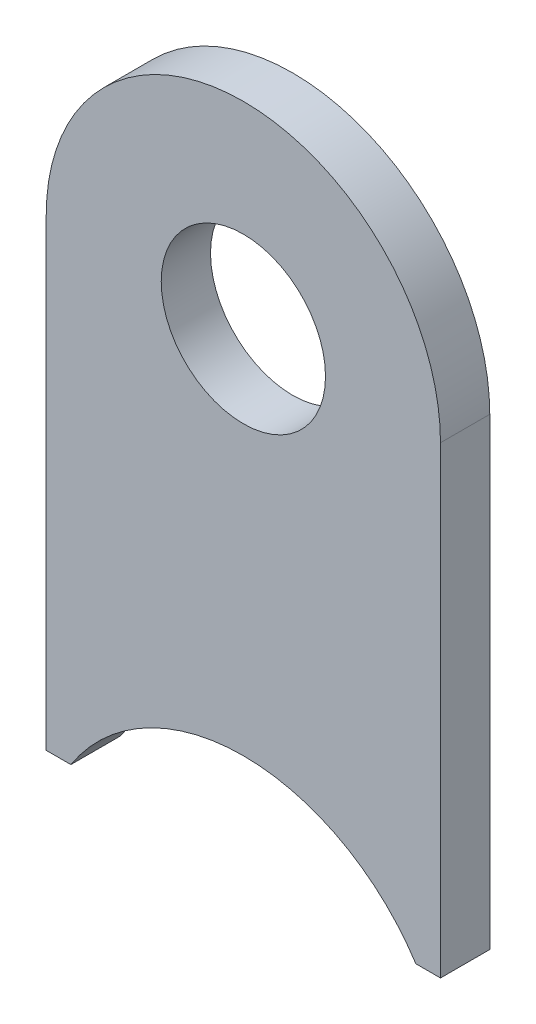
ISO-10303-21;
HEADER;
FILE_DESCRIPTION(('STEP AP214'),'2;1');
FILE_NAME('part.step','',(''),(''),'','','');
FILE_SCHEMA(('AUTOMOTIVE_DESIGN { 1 0 10303 214 1 1 1 1 }'));
ENDSEC;
DATA;
#1=APPLICATION_CONTEXT('core data for automotive mechanical design processes');
#2=APPLICATION_PROTOCOL_DEFINITION('international standard','automotive_design',2000,#1);
#3=PRODUCT_CONTEXT('',#1,'mechanical');
#4=PRODUCT('Part','Part','',(#3));
#5=PRODUCT_RELATED_PRODUCT_CATEGORY('part','',(#4));
#6=PRODUCT_DEFINITION_FORMATION('','',#4);
#7=PRODUCT_DEFINITION_CONTEXT('part definition',#1,'design');
#8=PRODUCT_DEFINITION('design','',#6,#7);
#9=PRODUCT_DEFINITION_SHAPE('','',#8);
#10=(LENGTH_UNIT() NAMED_UNIT(*) SI_UNIT(.MILLI.,.METRE.));
#11=(NAMED_UNIT(*) PLANE_ANGLE_UNIT() SI_UNIT($,.RADIAN.));
#12=(NAMED_UNIT(*) SI_UNIT($,.STERADIAN.) SOLID_ANGLE_UNIT());
#13=UNCERTAINTY_MEASURE_WITH_UNIT(LENGTH_MEASURE(1.E-05),#10,'distance_accuracy_value','');
#14=(GEOMETRIC_REPRESENTATION_CONTEXT(3) GLOBAL_UNCERTAINTY_ASSIGNED_CONTEXT((#13)) GLOBAL_UNIT_ASSIGNED_CONTEXT((#10,
#11,#12)) REPRESENTATION_CONTEXT('',''));
#15=CARTESIAN_POINT('',(0.,0.,0.));
#16=DIRECTION('',(0.,0.,1.));
#17=DIRECTION('',(1.,0.,0.));
#18=AXIS2_PLACEMENT_3D('',#15,#16,#17);
#19=CARTESIAN_POINT('',(0.,0.,1.5));
#20=DIRECTION('',(0.,0.,-1.));
#21=DIRECTION('',(-1.,0.,0.));
#22=AXIS2_PLACEMENT_3D('',#19,#20,#21);
#23=CYLINDRICAL_SURFACE('',#22,12.);
#24=CARTESIAN_POINT('',(0.,0.,-1.5));
#25=DIRECTION('',(0.,0.,-1.));
#26=DIRECTION('',(-1.,0.,0.));
#27=AXIS2_PLACEMENT_3D('',#24,#25,#26);
#28=CIRCLE('',#27,12.);
#29=CARTESIAN_POINT('',(-12.,0.,-1.5));
#30=VERTEX_POINT('',#29);
#31=CARTESIAN_POINT('',(12.,0.,-1.5));
#32=VERTEX_POINT('',#31);
#33=EDGE_CURVE('E119',#30,#32,#28,.T.);
#34=ORIENTED_EDGE('',*,*,#33,.F.);
#35=DIRECTION('',(0.,0.,-1.));
#36=VECTOR('',#35,1.);
#37=CARTESIAN_POINT('',(-12.,0.,1.5));
#38=LINE('',#37,#36);
#39=CARTESIAN_POINT('',(-12.,0.,1.5));
#40=VERTEX_POINT('',#39);
#41=EDGE_CURVE('E11',#40,#30,#38,.T.);
#42=ORIENTED_EDGE('',*,*,#41,.F.);
#43=CARTESIAN_POINT('',(0.,0.,1.5));
#44=DIRECTION('',(0.,0.,-1.));
#45=DIRECTION('',(-1.,0.,0.));
#46=AXIS2_PLACEMENT_3D('',#43,#44,#45);
#47=CIRCLE('',#46,12.);
#48=CARTESIAN_POINT('',(12.,0.,1.5));
#49=VERTEX_POINT('',#48);
#50=EDGE_CURVE('E134',#40,#49,#47,.T.);
#51=ORIENTED_EDGE('',*,*,#50,.T.);
#52=DIRECTION('',(0.,0.,-1.));
#53=VECTOR('',#52,1.);
#54=CARTESIAN_POINT('',(12.,0.,1.5));
#55=LINE('',#54,#53);
#56=EDGE_CURVE('E37',#49,#32,#55,.T.);
#57=ORIENTED_EDGE('',*,*,#56,.T.);
#58=EDGE_LOOP('',(#34,#42,#51,#57));
#59=FACE_BOUND('',#58,.T.);
#60=ADVANCED_FACE('F34',(#59),#23,.T.);
#61=CARTESIAN_POINT('',(-12.,-28.2176700168747,1.5));
#62=DIRECTION('',(-1.,0.,0.));
#63=DIRECTION('',(0.,-1.,0.));
#64=AXIS2_PLACEMENT_3D('',#61,#62,#63);
#65=PLANE('',#64);
#66=DIRECTION('',(0.,1.,0.));
#67=VECTOR('',#66,1.);
#68=CARTESIAN_POINT('',(-12.,-28.2176700168747,-1.5));
#69=LINE('',#68,#67);
#70=CARTESIAN_POINT('',(-12.,-28.2176700168747,-1.5));
#71=VERTEX_POINT('',#70);
#72=EDGE_CURVE('E132',#71,#30,#69,.T.);
#73=ORIENTED_EDGE('',*,*,#72,.F.);
#74=DIRECTION('',(0.,0.,-1.));
#75=VECTOR('',#74,1.);
#76=CARTESIAN_POINT('',(-12.,-28.2176700168747,1.5));
#77=LINE('',#76,#75);
#78=CARTESIAN_POINT('',(-12.,-28.2176700168747,1.5));
#79=VERTEX_POINT('',#78);
#80=EDGE_CURVE('E43',#79,#71,#77,.T.);
#81=ORIENTED_EDGE('',*,*,#80,.F.);
#82=DIRECTION('',(0.,1.,0.));
#83=VECTOR('',#82,1.);
#84=CARTESIAN_POINT('',(-12.,-28.2176700168747,1.5));
#85=LINE('',#84,#83);
#86=EDGE_CURVE('E109',#79,#40,#85,.T.);
#87=ORIENTED_EDGE('',*,*,#86,.T.);
#88=ORIENTED_EDGE('',*,*,#41,.T.);
#89=EDGE_LOOP('',(#73,#81,#87,#88));
#90=FACE_BOUND('',#89,.T.);
#91=ADVANCED_FACE('F142',(#90),#65,.T.);
#92=CARTESIAN_POINT('',(-10.5,-28.2176700168747,1.5));
#93=DIRECTION('',(0.,-1.,0.));
#94=DIRECTION('',(0.,0.,-1.));
#95=AXIS2_PLACEMENT_3D('',#92,#93,#94);
#96=PLANE('',#95);
#97=DIRECTION('',(-1.,0.,0.));
#98=VECTOR('',#97,1.);
#99=CARTESIAN_POINT('',(-10.5,-28.2176700168747,-1.5));
#100=LINE('',#99,#98);
#101=CARTESIAN_POINT('',(-10.5,-28.2176700168747,-1.5));
#102=VERTEX_POINT('',#101);
#103=EDGE_CURVE('E96',#102,#71,#100,.T.);
#104=ORIENTED_EDGE('',*,*,#103,.F.);
#105=DIRECTION('',(0.,0.,-1.));
#106=VECTOR('',#105,1.);
#107=CARTESIAN_POINT('',(-10.5,-28.2176700168747,1.5));
#108=LINE('',#107,#106);
#109=CARTESIAN_POINT('',(-10.5,-28.2176700168747,1.5));
#110=VERTEX_POINT('',#109);
#111=EDGE_CURVE('E91',#110,#102,#108,.T.);
#112=ORIENTED_EDGE('',*,*,#111,.F.);
#113=DIRECTION('',(-1.,0.,0.));
#114=VECTOR('',#113,1.);
#115=CARTESIAN_POINT('',(-10.5,-28.2176700168747,1.5));
#116=LINE('',#115,#114);
#117=EDGE_CURVE('E94',#110,#79,#116,.T.);
#118=ORIENTED_EDGE('',*,*,#117,.T.);
#119=ORIENTED_EDGE('',*,*,#80,.T.);
#120=EDGE_LOOP('',(#104,#112,#118,#119));
#121=FACE_BOUND('',#120,.T.);
#122=ADVANCED_FACE('F93',(#121),#96,.T.);
#123=CARTESIAN_POINT('',(0.,-35.,1.5));
#124=DIRECTION('',(0.,0.,-1.));
#125=DIRECTION('',(-1.,0.,0.));
#126=AXIS2_PLACEMENT_3D('',#123,#124,#125);
#127=CYLINDRICAL_SURFACE('',#126,12.5);
#128=CARTESIAN_POINT('',(0.,-35.,-1.5));
#129=DIRECTION('',(0.,0.,1.));
#130=DIRECTION('',(1.,0.,0.));
#131=AXIS2_PLACEMENT_3D('',#128,#129,#130);
#132=CIRCLE('',#131,12.5);
#133=CARTESIAN_POINT('',(10.5,-28.2176700168747,-1.5));
#134=VERTEX_POINT('',#133);
#135=EDGE_CURVE('E129',#134,#102,#132,.T.);
#136=ORIENTED_EDGE('',*,*,#135,.F.);
#137=DIRECTION('',(0.,0.,-1.));
#138=VECTOR('',#137,1.);
#139=CARTESIAN_POINT('',(10.5,-28.2176700168747,1.5));
#140=LINE('',#139,#138);
#141=CARTESIAN_POINT('',(10.5,-28.2176700168747,1.5));
#142=VERTEX_POINT('',#141);
#143=EDGE_CURVE('E101',#142,#134,#140,.T.);
#144=ORIENTED_EDGE('',*,*,#143,.F.);
#145=CARTESIAN_POINT('',(0.,-35.,1.5));
#146=DIRECTION('',(0.,0.,1.));
#147=DIRECTION('',(1.,0.,0.));
#148=AXIS2_PLACEMENT_3D('',#145,#146,#147);
#149=CIRCLE('',#148,12.5);
#150=EDGE_CURVE('E107',#142,#110,#149,.T.);
#151=ORIENTED_EDGE('',*,*,#150,.T.);
#152=ORIENTED_EDGE('',*,*,#111,.T.);
#153=EDGE_LOOP('',(#136,#144,#151,#152));
#154=FACE_BOUND('',#153,.T.);
#155=ADVANCED_FACE('F111',(#154),#127,.F.);
#156=CARTESIAN_POINT('',(12.,-28.2176700168747,1.5));
#157=DIRECTION('',(0.,-1.,0.));
#158=DIRECTION('',(0.,0.,-1.));
#159=AXIS2_PLACEMENT_3D('',#156,#157,#158);
#160=PLANE('',#159);
#161=DIRECTION('',(-1.,0.,0.));
#162=VECTOR('',#161,1.);
#163=CARTESIAN_POINT('',(12.,-28.2176700168747,-1.5));
#164=LINE('',#163,#162);
#165=CARTESIAN_POINT('',(12.,-28.2176700168747,-1.5));
#166=VERTEX_POINT('',#165);
#167=EDGE_CURVE('E126',#166,#134,#164,.T.);
#168=ORIENTED_EDGE('',*,*,#167,.F.);
#169=DIRECTION('',(0.,0.,-1.));
#170=VECTOR('',#169,1.);
#171=CARTESIAN_POINT('',(12.,-28.2176700168747,1.5));
#172=LINE('',#171,#170);
#173=CARTESIAN_POINT('',(12.,-28.2176700168747,1.5));
#174=VERTEX_POINT('',#173);
#175=EDGE_CURVE('E137',#174,#166,#172,.T.);
#176=ORIENTED_EDGE('',*,*,#175,.F.);
#177=DIRECTION('',(-1.,0.,0.));
#178=VECTOR('',#177,1.);
#179=CARTESIAN_POINT('',(12.,-28.2176700168747,1.5));
#180=LINE('',#179,#178);
#181=EDGE_CURVE('E112',#174,#142,#180,.T.);
#182=ORIENTED_EDGE('',*,*,#181,.T.);
#183=ORIENTED_EDGE('',*,*,#143,.T.);
#184=EDGE_LOOP('',(#168,#176,#182,#183));
#185=FACE_BOUND('',#184,.T.);
#186=ADVANCED_FACE('F155',(#185),#160,.T.);
#187=CARTESIAN_POINT('',(12.,0.,1.5));
#188=DIRECTION('',(1.,0.,0.));
#189=DIRECTION('',(0.,1.,0.));
#190=AXIS2_PLACEMENT_3D('',#187,#188,#189);
#191=PLANE('',#190);
#192=DIRECTION('',(0.,-1.,0.));
#193=VECTOR('',#192,1.);
#194=CARTESIAN_POINT('',(12.,0.,-1.5));
#195=LINE('',#194,#193);
#196=EDGE_CURVE('E122',#32,#166,#195,.T.);
#197=ORIENTED_EDGE('',*,*,#196,.F.);
#198=ORIENTED_EDGE('',*,*,#56,.F.);
#199=DIRECTION('',(0.,-1.,0.));
#200=VECTOR('',#199,1.);
#201=CARTESIAN_POINT('',(12.,0.,1.5));
#202=LINE('',#201,#200);
#203=EDGE_CURVE('E114',#49,#174,#202,.T.);
#204=ORIENTED_EDGE('',*,*,#203,.T.);
#205=ORIENTED_EDGE('',*,*,#175,.T.);
#206=EDGE_LOOP('',(#197,#198,#204,#205));
#207=FACE_BOUND('',#206,.T.);
#208=ADVANCED_FACE('F139',(#207),#191,.T.);
#209=CARTESIAN_POINT('',(0.,0.,1.5));
#210=DIRECTION('',(0.,0.,-1.));
#211=DIRECTION('',(-1.,0.,0.));
#212=AXIS2_PLACEMENT_3D('',#209,#210,#211);
#213=PLANE('',#212);
#214=CARTESIAN_POINT('',(0.,0.,1.5));
#215=DIRECTION('',(0.,0.,-1.));
#216=DIRECTION('',(1.,0.,0.));
#217=AXIS2_PLACEMENT_3D('',#214,#215,#216);
#218=CIRCLE('',#217,5.);
#219=CARTESIAN_POINT('',(5.,0.,1.5));
#220=VERTEX_POINT('',#219);
#221=EDGE_CURVE('E123',#220,#220,#218,.T.);
#222=ORIENTED_EDGE('',*,*,#221,.T.);
#223=EDGE_LOOP('',(#222));
#224=FACE_BOUND('',#223,.T.);
#225=ORIENTED_EDGE('',*,*,#50,.F.);
#226=ORIENTED_EDGE('',*,*,#86,.F.);
#227=ORIENTED_EDGE('',*,*,#117,.F.);
#228=ORIENTED_EDGE('',*,*,#150,.F.);
#229=ORIENTED_EDGE('',*,*,#181,.F.);
#230=ORIENTED_EDGE('',*,*,#203,.F.);
#231=EDGE_LOOP('',(#225,#226,#227,#228,#229,#230));
#232=FACE_BOUND('',#231,.T.);
#233=ADVANCED_FACE('F105',(#224,#232),#213,.F.);
#234=CARTESIAN_POINT('',(0.,0.,-1.5));
#235=DIRECTION('',(0.,0.,-1.));
#236=DIRECTION('',(-1.,0.,0.));
#237=AXIS2_PLACEMENT_3D('',#234,#235,#236);
#238=PLANE('',#237);
#239=CARTESIAN_POINT('',(0.,0.,-1.5));
#240=DIRECTION('',(0.,0.,-1.));
#241=DIRECTION('',(1.,0.,0.));
#242=AXIS2_PLACEMENT_3D('',#239,#240,#241);
#243=CIRCLE('',#242,5.);
#244=CARTESIAN_POINT('',(5.,0.,-1.5));
#245=VERTEX_POINT('',#244);
#246=EDGE_CURVE('E178',#245,#245,#243,.T.);
#247=ORIENTED_EDGE('',*,*,#246,.F.);
#248=EDGE_LOOP('',(#247));
#249=FACE_BOUND('',#248,.T.);
#250=ORIENTED_EDGE('',*,*,#33,.T.);
#251=ORIENTED_EDGE('',*,*,#196,.T.);
#252=ORIENTED_EDGE('',*,*,#167,.T.);
#253=ORIENTED_EDGE('',*,*,#135,.T.);
#254=ORIENTED_EDGE('',*,*,#103,.T.);
#255=ORIENTED_EDGE('',*,*,#72,.T.);
#256=EDGE_LOOP('',(#250,#251,#252,#253,#254,#255));
#257=FACE_BOUND('',#256,.T.);
#258=ADVANCED_FACE('F141',(#249,#257),#238,.T.);
#259=CARTESIAN_POINT('',(0.,0.,1.5));
#260=DIRECTION('',(0.,0.,-1.));
#261=DIRECTION('',(-1.,0.,0.));
#262=AXIS2_PLACEMENT_3D('',#259,#260,#261);
#263=CYLINDRICAL_SURFACE('',#262,5.);
#264=ORIENTED_EDGE('',*,*,#221,.F.);
#265=EDGE_LOOP('',(#264));
#266=FACE_BOUND('',#265,.T.);
#267=ORIENTED_EDGE('',*,*,#246,.T.);
#268=EDGE_LOOP('',(#267));
#269=FACE_BOUND('',#268,.T.);
#270=ADVANCED_FACE('F166',(#266,#269),#263,.F.);
#271=CLOSED_SHELL('',(#60,#91,#122,#155,#186,#208,#233,#258,#270));
#272=MANIFOLD_SOLID_BREP('B2',#271);
#273=ADVANCED_BREP_SHAPE_REPRESENTATION('',(#18,#272),#14);
#274=SHAPE_DEFINITION_REPRESENTATION(#9,#273);
ENDSEC;
END-ISO-10303-21;
